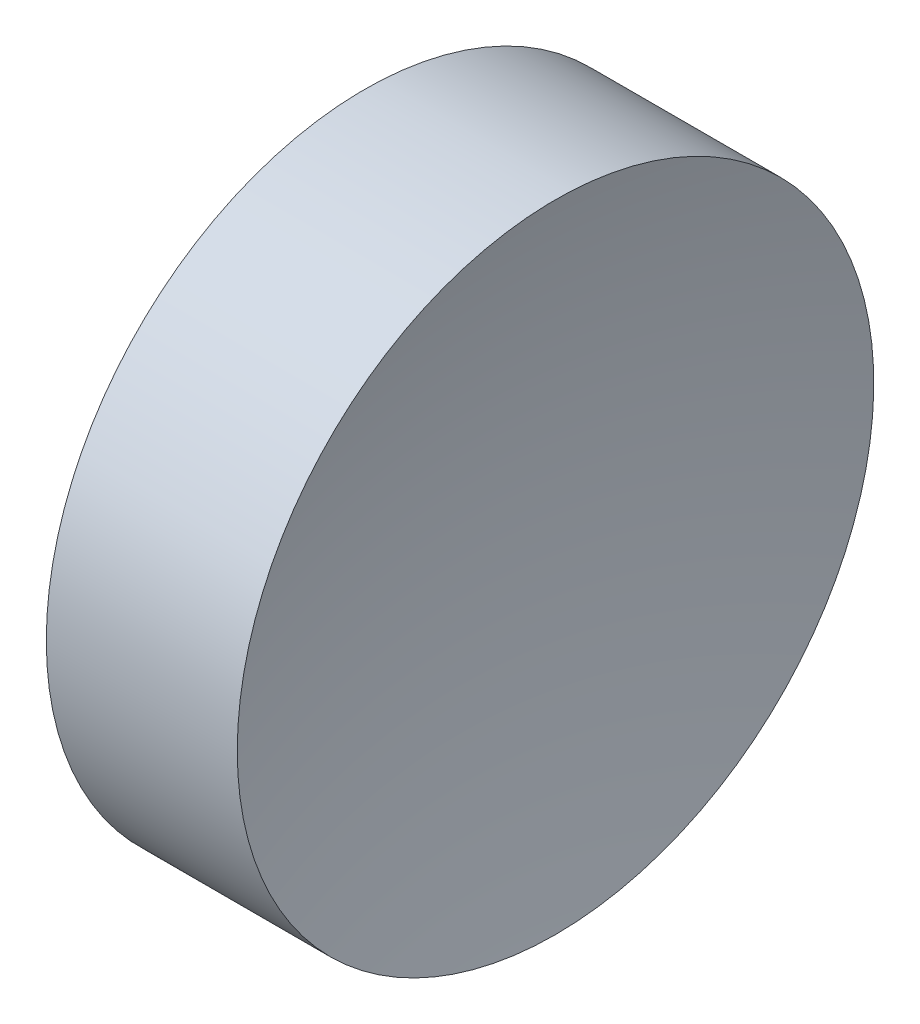
ISO-10303-21;
HEADER;
FILE_DESCRIPTION(('STEP AP214'),'2;1');
FILE_NAME('part.step','',(''),(''),'','','');
FILE_SCHEMA(('AUTOMOTIVE_DESIGN { 1 0 10303 214 1 1 1 1 }'));
ENDSEC;
DATA;
#1=APPLICATION_CONTEXT('core data for automotive mechanical design processes');
#2=APPLICATION_PROTOCOL_DEFINITION('international standard','automotive_design',2000,#1);
#3=PRODUCT_CONTEXT('',#1,'mechanical');
#4=PRODUCT('Part','Part','',(#3));
#5=PRODUCT_RELATED_PRODUCT_CATEGORY('part','',(#4));
#6=PRODUCT_DEFINITION_FORMATION('','',#4);
#7=PRODUCT_DEFINITION_CONTEXT('part definition',#1,'design');
#8=PRODUCT_DEFINITION('design','',#6,#7);
#9=PRODUCT_DEFINITION_SHAPE('','',#8);
#10=(LENGTH_UNIT() NAMED_UNIT(*) SI_UNIT(.MILLI.,.METRE.));
#11=(NAMED_UNIT(*) PLANE_ANGLE_UNIT() SI_UNIT($,.RADIAN.));
#12=(NAMED_UNIT(*) SI_UNIT($,.STERADIAN.) SOLID_ANGLE_UNIT());
#13=UNCERTAINTY_MEASURE_WITH_UNIT(LENGTH_MEASURE(1.E-05),#10,'distance_accuracy_value','');
#14=(GEOMETRIC_REPRESENTATION_CONTEXT(3) GLOBAL_UNCERTAINTY_ASSIGNED_CONTEXT((#13)) GLOBAL_UNIT_ASSIGNED_CONTEXT((#10,
#11,#12)) REPRESENTATION_CONTEXT('',''));
#15=CARTESIAN_POINT('',(0.,0.,0.));
#16=DIRECTION('',(0.,0.,1.));
#17=DIRECTION('',(1.,0.,0.));
#18=AXIS2_PLACEMENT_3D('',#15,#16,#17);
#19=CARTESIAN_POINT('',(36.5883433213561,13.0445205745975,0.));
#20=DIRECTION('',(-1.,0.,0.));
#21=DIRECTION('',(0.,-1.,0.));
#22=AXIS2_PLACEMENT_3D('',#19,#20,#21);
#23=SPHERICAL_SURFACE('',#22,12.9161538461538);
#24=CARTESIAN_POINT('',(24.0621894752023,13.0445205745975,0.));
#25=DIRECTION('',(-1.,0.,0.));
#26=DIRECTION('',(0.,0.,1.));
#27=AXIS2_PLACEMENT_3D('',#24,#25,#26);
#28=CIRCLE('',#27,3.15);
#29=CARTESIAN_POINT('',(24.0621894752023,13.0445205745975,3.15));
#30=VERTEX_POINT('',#29);
#31=EDGE_CURVE('E10',#30,#30,#28,.T.);
#32=ORIENTED_EDGE('',*,*,#31,.F.);
#33=EDGE_LOOP('',(#32));
#34=FACE_BOUND('',#33,.T.);
#35=ADVANCED_FACE('F35',(#34),#23,.F.);
#36=CARTESIAN_POINT('',(21.2249305570684,13.0445205745975,0.));
#37=DIRECTION('',(-1.,0.,0.));
#38=DIRECTION('',(0.,0.,1.));
#39=AXIS2_PLACEMENT_3D('',#36,#37,#38);
#40=CYLINDRICAL_SURFACE('',#39,3.15);
#41=CARTESIAN_POINT('',(22.1721894752023,13.0445205745975,0.));
#42=DIRECTION('',(-1.,0.,0.));
#43=DIRECTION('',(0.,0.,1.));
#44=AXIS2_PLACEMENT_3D('',#41,#42,#43);
#45=CIRCLE('',#44,3.15);
#46=CARTESIAN_POINT('',(22.1721894752023,13.0445205745975,3.15));
#47=VERTEX_POINT('',#46);
#48=EDGE_CURVE('E41',#47,#47,#45,.T.);
#49=ORIENTED_EDGE('',*,*,#48,.F.);
#50=EDGE_LOOP('',(#49));
#51=FACE_BOUND('',#50,.T.);
#52=ORIENTED_EDGE('',*,*,#31,.T.);
#53=EDGE_LOOP('',(#52));
#54=FACE_BOUND('',#53,.T.);
#55=ADVANCED_FACE('F49',(#51,#54),#40,.T.);
#56=CARTESIAN_POINT('',(22.1721894752023,13.0445205745975,0.));
#57=DIRECTION('',(1.,0.,0.));
#58=DIRECTION('',(0.,0.,-1.));
#59=AXIS2_PLACEMENT_3D('',#56,#57,#58);
#60=PLANE('',#59);
#61=ORIENTED_EDGE('',*,*,#48,.T.);
#62=EDGE_LOOP('',(#61));
#63=FACE_BOUND('',#62,.T.);
#64=ADVANCED_FACE('F47',(#63),#60,.F.);
#65=CLOSED_SHELL('',(#35,#55,#64));
#66=MANIFOLD_SOLID_BREP('B2',#65);
#67=ADVANCED_BREP_SHAPE_REPRESENTATION('',(#18,#66),#14);
#68=SHAPE_DEFINITION_REPRESENTATION(#9,#67);
ENDSEC;
END-ISO-10303-21;
